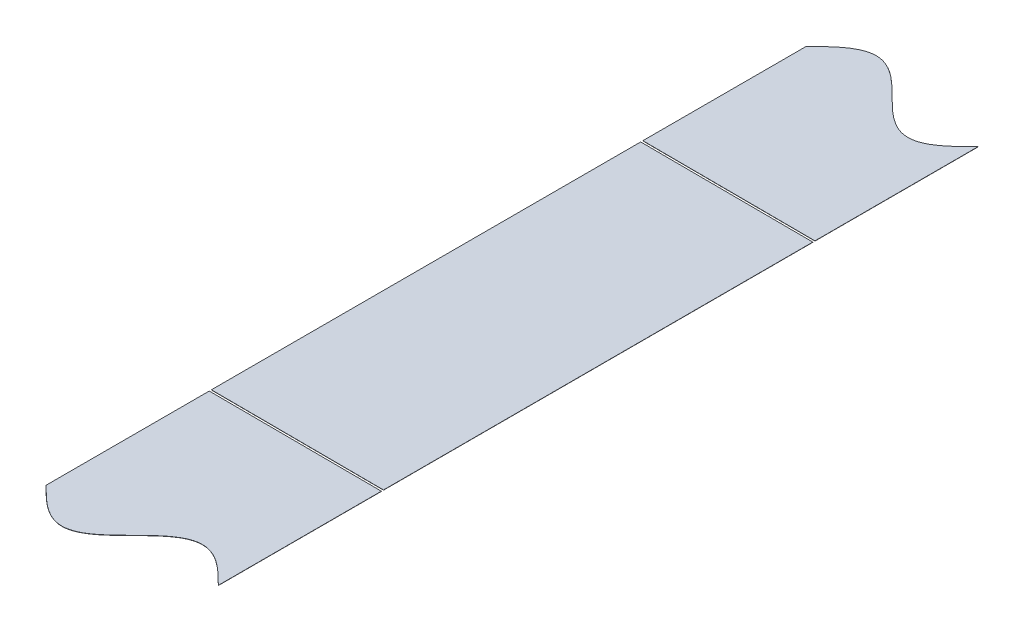
ISO-10303-21;
HEADER;
FILE_DESCRIPTION(('STEP AP214'),'2;1');
FILE_NAME('part.step','',(''),(''),'','','');
FILE_SCHEMA(('AUTOMOTIVE_DESIGN { 1 0 10303 214 1 1 1 1 }'));
ENDSEC;
DATA;
#1=APPLICATION_CONTEXT('core data for automotive mechanical design processes');
#2=APPLICATION_PROTOCOL_DEFINITION('international standard','automotive_design',2000,#1);
#3=PRODUCT_CONTEXT('',#1,'mechanical');
#4=PRODUCT('Part','Part','',(#3));
#5=PRODUCT_RELATED_PRODUCT_CATEGORY('part','',(#4));
#6=PRODUCT_DEFINITION_FORMATION('','',#4);
#7=PRODUCT_DEFINITION_CONTEXT('part definition',#1,'design');
#8=PRODUCT_DEFINITION('design','',#6,#7);
#9=PRODUCT_DEFINITION_SHAPE('','',#8);
#10=(LENGTH_UNIT() NAMED_UNIT(*) SI_UNIT(.MILLI.,.METRE.));
#11=(NAMED_UNIT(*) PLANE_ANGLE_UNIT() SI_UNIT($,.RADIAN.));
#12=(NAMED_UNIT(*) SI_UNIT($,.STERADIAN.) SOLID_ANGLE_UNIT());
#13=UNCERTAINTY_MEASURE_WITH_UNIT(LENGTH_MEASURE(1.E-05),#10,'distance_accuracy_value','');
#14=(GEOMETRIC_REPRESENTATION_CONTEXT(3) GLOBAL_UNCERTAINTY_ASSIGNED_CONTEXT((#13)) GLOBAL_UNIT_ASSIGNED_CONTEXT((#10,
#11,#12)) REPRESENTATION_CONTEXT('',''));
#15=CARTESIAN_POINT('',(0.,0.,0.));
#16=DIRECTION('',(0.,0.,1.));
#17=DIRECTION('',(1.,0.,0.));
#18=AXIS2_PLACEMENT_3D('',#15,#16,#17);
#19=CARTESIAN_POINT('',(-621.794395504832,395.512091266232,-3681.16559912433));
#20=DIRECTION('',(0.00396825396827997,0.999992126449225,0.));
#21=DIRECTION('',(-0.999992126449225,0.00396825396827997,0.));
#22=AXIS2_PLACEMENT_3D('',#19,#20,#21);
#23=PLANE('',#22);
#24=DIRECTION('',(0.,0.,1.));
#25=VECTOR('',#24,1.);
#26=CARTESIAN_POINT('',(2884.05,381.59990079326,-175.293599958301));
#27=LINE('',#26,#25);
#28=CARTESIAN_POINT('',(2884.05,381.59990079326,100.));
#29=VERTEX_POINT('',#28);
#30=CARTESIAN_POINT('',(2884.05,381.59990079326,175.293599958303));
#31=VERTEX_POINT('',#30);
#32=EDGE_CURVE('E110',#29,#31,#27,.T.);
#33=ORIENTED_EDGE('',*,*,#32,.F.);
#34=DIRECTION('',(0.999992126449225,-0.00396825396827997,0.));
#35=VECTOR('',#34,1.);
#36=CARTESIAN_POINT('',(-621.794395504832,395.512091266232,100.));
#37=LINE('',#36,#35);
#38=CARTESIAN_POINT('',(2963.43127202954,381.284893265294,100.));
#39=VERTEX_POINT('',#38);
#40=EDGE_CURVE('E70',#29,#39,#37,.T.);
#41=ORIENTED_EDGE('',*,*,#40,.T.);
#42=DIRECTION('',(0.,0.,1.));
#43=VECTOR('',#42,1.);
#44=CARTESIAN_POINT('',(2963.43127202953,381.284893265294,-175.193599958301));
#45=LINE('',#44,#43);
#46=CARTESIAN_POINT('',(2963.43127202954,381.284893265294,175.193599958303));
#47=VERTEX_POINT('',#46);
#48=EDGE_CURVE('E57',#39,#47,#45,.T.);
#49=ORIENTED_EDGE('',*,*,#48,.T.);
#50=CARTESIAN_POINT('',(2884.05,381.59990079326,175.293599958303));
#51=CARTESIAN_POINT('',(2884.44900275421,381.598317436531,175.691025621414));
#52=CARTESIAN_POINT('',(2884.67016618773,381.597439796948,175.911007405777));
#53=CARTESIAN_POINT('',(2885.01284043788,381.596079967788,176.251850789343));
#54=CARTESIAN_POINT('',(2885.62029802492,381.593669402828,176.853766323541));
#55=CARTESIAN_POINT('',(2886.2348307219,381.591230761814,177.458905931201));
#56=CARTESIAN_POINT('',(2886.85180442637,381.588782434186,178.061187776924));
#57=CARTESIAN_POINT('',(2887.46990703982,381.586329626725,178.657850633466));
#58=CARTESIAN_POINT('',(2888.08862391969,381.58387438168,179.246943539566));
#59=CARTESIAN_POINT('',(2888.70771164539,381.581417665012,179.826805292829));
#60=CARTESIAN_POINT('',(2889.32704055818,381.578959991246,180.395911021721));
#61=CARTESIAN_POINT('',(2889.94653500399,381.576501660597,180.952816062257));
#62=CARTESIAN_POINT('',(2890.88857872217,381.572763362441,181.778862747914));
#63=CARTESIAN_POINT('',(2892.12570234937,381.567854103044,182.801225095618));
#64=CARTESIAN_POINT('',(2893.36357306313,381.562941878996,183.751910080358));
#65=CARTESIAN_POINT('',(2894.60192315181,381.558027752651,184.621504416246));
#66=CARTESIAN_POINT('',(2895.84059602389,381.553112345409,185.401489653719));
#67=CARTESIAN_POINT('',(2897.07949333798,381.548196047517,186.084270089632));
#68=CARTESIAN_POINT('',(2898.3185495348,381.543279119134,186.663219669498));
#69=CARTESIAN_POINT('',(2899.55771848087,381.538361743329,187.132732016565));
#70=CARTESIAN_POINT('',(2900.79696596885,381.533444055847,187.488266726695));
#71=CARTESIAN_POINT('',(2902.02997589461,381.528551120792,187.725180183972));
#72=CARTESIAN_POINT('',(2903.25680530536,381.523682711782,187.843600231955));
#73=CARTESIAN_POINT('',(2903.88275359037,381.521198770459,187.843599952654));
#74=CARTESIAN_POINT('',(2904.51493130274,381.518690108991,187.842352340713));
#75=CARTESIAN_POINT('',(2905.75425897102,381.513772103331,187.719074671948));
#76=CARTESIAN_POINT('',(2906.99355651627,381.508854217208,187.476155306059));
#77=CARTESIAN_POINT('',(2908.23280138851,381.503936540107,187.115940101572));
#78=CARTESIAN_POINT('',(2909.47196651117,381.499019179474,186.641909561395));
#79=CARTESIAN_POINT('',(2910.71101730635,381.494102272526,186.058647977678));
#80=CARTESIAN_POINT('',(2911.949906989,381.489186004918,185.371803892243));
#81=CARTESIAN_POINT('',(2913.18856897751,381.484270640865,184.588043540144));
#82=CARTESIAN_POINT('',(2914.42690322463,381.479356577384,183.715000747353));
#83=CARTESIAN_POINT('',(2915.66475000555,381.474444448308,182.761230401478));
#84=CARTESIAN_POINT('',(2916.90183509568,381.469535341837,181.736182119725));
#85=CARTESIAN_POINT('',(2917.84398064896,381.46579663957,180.908288699699));
#86=CARTESIAN_POINT('',(2918.4634637693,381.463338353864,180.350345268312));
#87=CARTESIAN_POINT('',(2919.08277664979,381.460880743718,179.780315465008));
#88=CARTESIAN_POINT('',(2919.70184033163,381.458424122464,179.199649485736));
#89=CARTESIAN_POINT('',(2920.32051875954,381.455969030007,178.609880564441));
#90=CARTESIAN_POINT('',(2920.93855497185,381.453516486045,178.012685115911));
#91=CARTESIAN_POINT('',(2921.55539810147,381.451068676575,177.410051600892));
#92=CARTESIAN_POINT('',(2922.16961633362,381.448631283447,176.804861613959));
#93=CARTESIAN_POINT('',(2922.77595992045,381.446225139157,176.203810908444));
#94=CARTESIAN_POINT('',(2923.25825852217,381.444311240748,175.72399210532));
#95=CARTESIAN_POINT('',(2923.5338910667,381.443217452197,175.449529353548));
#96=CARTESIAN_POINT('',(2923.94733401057,381.441576792677,175.03771733011));
#97=CARTESIAN_POINT('',(2924.2229455626,381.440483087431,174.763275444279));
#98=CARTESIAN_POINT('',(2924.70524378095,381.438569190543,174.283456891095));
#99=CARTESIAN_POINT('',(2925.31158597793,381.436163051768,173.68240723069));
#100=CARTESIAN_POINT('',(2925.92580402107,381.43372565939,173.077216931859));
#101=CARTESIAN_POINT('',(2926.54264687146,381.431277851029,172.474583022645));
#102=CARTESIAN_POINT('',(2927.16068278245,381.428825308262,171.87738703287));
#103=CARTESIAN_POINT('',(2927.77936114426,381.426370216067,171.287617173664));
#104=CARTESIAN_POINT('',(2928.39842473084,381.423913595191,170.70695012669));
#105=CARTESIAN_POINT('',(2929.01773738759,381.421455985933,170.136919206769));
#106=CARTESIAN_POINT('',(2929.63722048514,381.418997700318,169.578974317699));
#107=CARTESIAN_POINT('',(2930.57936625014,381.41525899721,168.751078232698));
#108=CARTESIAN_POINT('',(2931.81645132748,381.410349890791,167.726026132325));
#109=CARTESIAN_POINT('',(2933.05429806009,381.405437761906,166.772251445878));
#110=CARTESIAN_POINT('',(2934.29263226124,381.400523698607,165.899203804224));
#111=CARTESIAN_POINT('',(2935.53129425844,381.39560833452,165.115438104594));
#112=CARTESIAN_POINT('',(2936.77018396465,381.390692066819,164.428588266424));
#113=CARTESIAN_POINT('',(2938.00923473979,381.38577515995,163.84532060058));
#114=CARTESIAN_POINT('',(2939.24839986578,381.380857799304,163.371283676504));
#115=CARTESIAN_POINT('',(2940.48764473458,381.375940122216,163.011061862295));
#116=CARTESIAN_POINT('',(2941.72694226685,381.371022236145,162.768135720721));
#117=CARTESIAN_POINT('',(2942.96626993122,381.3661042305,162.644851172782));
#118=CARTESIAN_POINT('',(2944.20560763773,381.361186185006,162.642398407556));
#119=CARTESIAN_POINT('',(2945.44493609165,381.356268176228,162.76080110203));
#120=CARTESIAN_POINT('',(2946.68423526271,381.351350283654,162.998916205654));
#121=CARTESIAN_POINT('',(2947.92348275768,381.346432596144,163.354444296083));
#122=CARTESIAN_POINT('',(2949.1626517136,381.341515220301,163.823950253892));
#123=CARTESIAN_POINT('',(2950.40170791263,381.336598291908,164.402893729754));
#124=CARTESIAN_POINT('',(2951.64060525855,381.33168199389,165.085668425485));
#125=CARTESIAN_POINT('',(2952.87927816171,381.326766586525,165.865648331297));
#126=CARTESIAN_POINT('',(2954.11762830693,381.321852459956,166.735237808971));
#127=CARTESIAN_POINT('',(2955.35549906181,381.316940235744,167.685918434696));
#128=CARTESIAN_POINT('',(2956.59262269846,381.31203097631,168.70827693913));
#129=CARTESIAN_POINT('',(2957.5346662733,381.308292678722,169.534321007098));
#130=CARTESIAN_POINT('',(2958.1541606404,381.305834348386,170.091224489268));
#131=CARTESIAN_POINT('',(2958.77348967054,381.303376674154,170.660328989489));
#132=CARTESIAN_POINT('',(2959.39257759728,381.300919956689,171.240189760136));
#133=CARTESIAN_POINT('',(2960.01129436986,381.298464712069,171.829281552269));
#134=CARTESIAN_POINT('',(2960.62939725599,381.296011903526,172.42594382095));
#135=CARTESIAN_POINT('',(2961.2463711206,381.293563575262,173.028225144418));
#136=CARTESIAN_POINT('',(2961.86090358267,381.29112493518,173.633364003138));
#137=CARTESIAN_POINT('',(2962.46836304824,381.288714362766,174.235281049865));
#138=CARTESIAN_POINT('',(2962.8111058418,381.287354261606,174.57619251083));
#139=CARTESIAN_POINT('',(2963.03222295052,381.286476805854,174.796128153504));
#140=CARTESIAN_POINT('',(2963.43127202954,381.284893265294,175.193599958303));
#141=B_SPLINE_CURVE_WITH_KNOTS('',2,(#50,#51,#52,#53,#54,#55,#56,#57,#58,#59,#60,#61,#62,#63,
#64,#65,#66,#67,#68,#69,#70,#71,#72,#73,#74,#75,#76,#77,#78,#79,#80,#81,#82,#83,#84,#85,#86,#87,
#88,#89,#90,#91,#92,#93,#94,#95,#96,#97,#98,#99,#100,#101,#102,#103,#104,#105,#106,#107,#108,
#109,#110,#111,#112,#113,#114,#115,#116,#117,#118,#119,#120,#121,#122,#123,#124,#125,#126,#127,
#128,#129,#130,#131,#132,#133,#134,#135,#136,#137,#138,#139,#140),.UNSPECIFIED.,.F.,.F.,(3,2,1,
1,1,1,1,1,1,1,1,1,1,1,1,1,1,1,1,1,1,1,1,1,1,1,1,1,1,1,1,1,1,1,1,1,1,1,1,1,1,1,1,1,1,1,1,1,1,1,1,
1,1,1,1,1,1,1,1,1,1,1,1,1,1,1,1,1,1,1,1,1,1,1,1,1,1,1,1,1,1,1,1,1,1,1,2,3),(0.,0.0078125,
0.015625,0.0234375,0.03125,0.0390625,0.046875,0.0546875,0.0625,0.0703125,0.078125,0.09375,
0.109375,0.125,0.140625,0.15625,0.171875,0.1875,0.203125,0.21875,0.234217166900635,
0.24968433380127,0.25,0.265625,0.28125,0.296875,0.3125,0.328125,0.34375,0.359375,0.375,0.390625,
0.40625,0.421875,0.4296875,0.4375,0.4453125,0.453125,0.4609375,0.46875,0.4765625,0.484375,
0.4921875,0.49609375,0.5,0.50390625,0.5078125,0.515625,0.5234375,0.53125,0.5390625,0.546875,
0.5546875,0.5625,0.5703125,0.578125,0.59375,0.609375,0.625,0.640625,0.65625,0.671875,0.6875,
0.703125,0.71875,0.734375,0.75,0.765625,0.78125,0.796875,0.8125,0.828125,0.84375,0.859375,0.875,
0.890625,0.90625,0.921875,0.9296875,0.9375,0.9453125,0.953125,0.9609375,0.96875,0.9765625,
0.984375,0.9921875,1.),.UNSPECIFIED.);
#142=EDGE_CURVE('E120',#31,#47,#141,.T.);
#143=ORIENTED_EDGE('',*,*,#142,.F.);
#144=EDGE_LOOP('',(#33,#41,#49,#143));
#145=FACE_BOUND('',#144,.T.);
#146=ADVANCED_FACE('F54',(#145),#23,.F.);
#147=CARTESIAN_POINT('',(-621.793998679435,395.612090478877,-3681.16559912433));
#148=DIRECTION('',(0.00396825396827997,0.999992126449225,0.));
#149=DIRECTION('',(-0.999992126449225,0.00396825396827997,0.));
#150=AXIS2_PLACEMENT_3D('',#147,#148,#149);
#151=PLANE('',#150);
#152=DIRECTION('',(0.999992126449225,-0.00396825396828014,0.));
#153=VECTOR('',#152,1.);
#154=CARTESIAN_POINT('',(2884.0503968254,381.699900005905,100.));
#155=LINE('',#154,#153);
#156=CARTESIAN_POINT('',(2884.0503968254,381.699900005905,100.));
#157=VERTEX_POINT('',#156);
#158=CARTESIAN_POINT('',(2963.43166885493,381.384892477939,100.));
#159=VERTEX_POINT('',#158);
#160=EDGE_CURVE('E63',#157,#159,#155,.T.);
#161=ORIENTED_EDGE('',*,*,#160,.F.);
#162=DIRECTION('',(0.,0.,1.));
#163=VECTOR('',#162,1.);
#164=CARTESIAN_POINT('',(2884.0503968254,381.699900005905,-175.293599958301));
#165=LINE('',#164,#163);
#166=CARTESIAN_POINT('',(2884.0503968254,381.699900005905,175.293599958303));
#167=VERTEX_POINT('',#166);
#168=EDGE_CURVE('E101',#157,#167,#165,.T.);
#169=ORIENTED_EDGE('',*,*,#168,.T.);
#170=CARTESIAN_POINT('',(2884.0503968254,381.699900005905,175.293599958303));
#171=CARTESIAN_POINT('',(2884.44939957961,381.698316649176,175.691025621414));
#172=CARTESIAN_POINT('',(2884.67056301313,381.697439009593,175.911007405777));
#173=CARTESIAN_POINT('',(2885.01323726327,381.696079180433,176.251850789343));
#174=CARTESIAN_POINT('',(2885.62069485032,381.693668615473,176.853766323541));
#175=CARTESIAN_POINT('',(2886.2352275473,381.691229974459,177.458905931201));
#176=CARTESIAN_POINT('',(2886.85220125176,381.688781646831,178.061187776924));
#177=CARTESIAN_POINT('',(2887.47030386521,381.68632883937,178.657850633466));
#178=CARTESIAN_POINT('',(2888.08902074509,381.683873594325,179.246943539566));
#179=CARTESIAN_POINT('',(2888.70810847079,381.681416877657,179.826805292829));
#180=CARTESIAN_POINT('',(2889.32743738357,381.678959203891,180.395911021721));
#181=CARTESIAN_POINT('',(2889.94693182939,381.676500873242,180.952816062257));
#182=CARTESIAN_POINT('',(2890.88897554757,381.672762575086,181.778862747914));
#183=CARTESIAN_POINT('',(2892.12609917477,381.667853315689,182.801225095618));
#184=CARTESIAN_POINT('',(2893.36396988853,381.662941091641,183.751910080358));
#185=CARTESIAN_POINT('',(2894.60231997721,381.658026965295,184.621504416246));
#186=CARTESIAN_POINT('',(2895.84099284928,381.653111558054,185.401489653719));
#187=CARTESIAN_POINT('',(2897.07989016338,381.648195260162,186.084270089632));
#188=CARTESIAN_POINT('',(2898.3189463602,381.643278331778,186.663219669498));
#189=CARTESIAN_POINT('',(2899.55811530626,381.638360955974,187.132732016565));
#190=CARTESIAN_POINT('',(2900.79736279425,381.633443268492,187.488266726695));
#191=CARTESIAN_POINT('',(2902.03037272001,381.628550333437,187.725180183972));
#192=CARTESIAN_POINT('',(2903.25720213076,381.623681924427,187.843600231955));
#193=CARTESIAN_POINT('',(2903.88315041577,381.621197983104,187.843599952654));
#194=CARTESIAN_POINT('',(2904.51532812814,381.618689321636,187.842352340713));
#195=CARTESIAN_POINT('',(2905.75465579642,381.613771315976,187.719074671948));
#196=CARTESIAN_POINT('',(2906.99395334167,381.608853429853,187.476155306059));
#197=CARTESIAN_POINT('',(2908.23319821391,381.603935752752,187.115940101572));
#198=CARTESIAN_POINT('',(2909.47236333657,381.599018392119,186.641909561395));
#199=CARTESIAN_POINT('',(2910.71141413175,381.594101485171,186.058647977678));
#200=CARTESIAN_POINT('',(2911.9503038144,381.589185217563,185.371803892243));
#201=CARTESIAN_POINT('',(2913.18896580291,381.58426985351,184.588043540144));
#202=CARTESIAN_POINT('',(2914.42730005002,381.579355790029,183.715000747353));
#203=CARTESIAN_POINT('',(2915.66514683095,381.574443660953,182.761230401478));
#204=CARTESIAN_POINT('',(2916.90223192108,381.569534554482,181.736182119725));
#205=CARTESIAN_POINT('',(2917.84437747436,381.565795852215,180.908288699699));
#206=CARTESIAN_POINT('',(2918.4638605947,381.563337566509,180.350345268312));
#207=CARTESIAN_POINT('',(2919.08317347519,381.560879956363,179.780315465008));
#208=CARTESIAN_POINT('',(2919.70223715703,381.558423335109,179.199649485736));
#209=CARTESIAN_POINT('',(2920.32091558493,381.555968242652,178.609880564441));
#210=CARTESIAN_POINT('',(2920.93895179724,381.55351569869,178.012685115911));
#211=CARTESIAN_POINT('',(2921.55579492686,381.55106788922,177.410051600892));
#212=CARTESIAN_POINT('',(2922.17001315902,381.548630496092,176.804861613959));
#213=CARTESIAN_POINT('',(2922.77635674585,381.546224351802,176.203810908444));
#214=CARTESIAN_POINT('',(2923.25865534757,381.544310453393,175.72399210532));
#215=CARTESIAN_POINT('',(2923.5342878921,381.543216664842,175.449529353548));
#216=CARTESIAN_POINT('',(2923.94773083597,381.541576005322,175.03771733011));
#217=CARTESIAN_POINT('',(2924.223342388,381.540482300075,174.763275444279));
#218=CARTESIAN_POINT('',(2924.70564060634,381.538568403187,174.283456891095));
#219=CARTESIAN_POINT('',(2925.31198280333,381.536162264413,173.68240723069));
#220=CARTESIAN_POINT('',(2925.92620084646,381.533724872035,173.077216931859));
#221=CARTESIAN_POINT('',(2926.54304369686,381.531277063673,172.474583022645));
#222=CARTESIAN_POINT('',(2927.16107960785,381.528824520907,171.87738703287));
#223=CARTESIAN_POINT('',(2927.77975796965,381.526369428712,171.287617173664));
#224=CARTESIAN_POINT('',(2928.39882155624,381.523912807836,170.70695012669));
#225=CARTESIAN_POINT('',(2929.01813421299,381.521455198578,170.136919206769));
#226=CARTESIAN_POINT('',(2929.63761731054,381.518996912962,169.578974317699));
#227=CARTESIAN_POINT('',(2930.57976307553,381.515258209855,168.751078232698));
#228=CARTESIAN_POINT('',(2931.81684815288,381.510349103436,167.726026132325));
#229=CARTESIAN_POINT('',(2933.05469488548,381.505436974551,166.772251445878));
#230=CARTESIAN_POINT('',(2934.29302908664,381.500522911252,165.899203804224));
#231=CARTESIAN_POINT('',(2935.53169108384,381.495607547165,165.115438104594));
#232=CARTESIAN_POINT('',(2936.77058079004,381.490691279463,164.428588266424));
#233=CARTESIAN_POINT('',(2938.00963156519,381.485774372595,163.84532060058));
#234=CARTESIAN_POINT('',(2939.24879669118,381.480857011949,163.371283676504));
#235=CARTESIAN_POINT('',(2940.48804155998,381.475939334861,163.011061862295));
#236=CARTESIAN_POINT('',(2941.72733909225,381.47102144879,162.768135720721));
#237=CARTESIAN_POINT('',(2942.96666675661,381.466103443145,162.644851172782));
#238=CARTESIAN_POINT('',(2944.20600446313,381.461185397651,162.642398407556));
#239=CARTESIAN_POINT('',(2945.44533291705,381.456267388873,162.76080110203));
#240=CARTESIAN_POINT('',(2946.68463208811,381.451349496299,162.998916205654));
#241=CARTESIAN_POINT('',(2947.92387958308,381.446431808789,163.354444296083));
#242=CARTESIAN_POINT('',(2949.163048539,381.441514432945,163.823950253892));
#243=CARTESIAN_POINT('',(2950.40210473803,381.436597504553,164.402893729754));
#244=CARTESIAN_POINT('',(2951.64100208395,381.431681206535,165.085668425485));
#245=CARTESIAN_POINT('',(2952.87967498711,381.42676579917,165.865648331297));
#246=CARTESIAN_POINT('',(2954.11802513233,381.4218516726,166.735237808971));
#247=CARTESIAN_POINT('',(2955.35589588721,381.416939448389,167.685918434696));
#248=CARTESIAN_POINT('',(2956.59301952386,381.412030188955,168.70827693913));
#249=CARTESIAN_POINT('',(2957.5350630987,381.408291891367,169.534321007098));
#250=CARTESIAN_POINT('',(2958.1545574658,381.405833561031,170.091224489268));
#251=CARTESIAN_POINT('',(2958.77388649593,381.403375886799,170.660328989489));
#252=CARTESIAN_POINT('',(2959.39297442267,381.400919169334,171.240189760136));
#253=CARTESIAN_POINT('',(2960.01169119526,381.398463924714,171.829281552269));
#254=CARTESIAN_POINT('',(2960.62979408138,381.396011116171,172.42594382095));
#255=CARTESIAN_POINT('',(2961.246767946,381.393562787907,173.028225144418));
#256=CARTESIAN_POINT('',(2961.86130040807,381.391124147825,173.633364003138));
#257=CARTESIAN_POINT('',(2962.46875987363,381.388713575411,174.235281049865));
#258=CARTESIAN_POINT('',(2962.8115026672,381.387353474251,174.57619251083));
#259=CARTESIAN_POINT('',(2963.03261977591,381.386476018499,174.796128153504));
#260=CARTESIAN_POINT('',(2963.43166885493,381.384892477939,175.193599958303));
#261=B_SPLINE_CURVE_WITH_KNOTS('',2,(#170,#171,#172,#173,#174,#175,#176,#177,#178,#179,#180,
#181,#182,#183,#184,#185,#186,#187,#188,#189,#190,#191,#192,#193,#194,#195,#196,#197,#198,#199,
#200,#201,#202,#203,#204,#205,#206,#207,#208,#209,#210,#211,#212,#213,#214,#215,#216,#217,#218,
#219,#220,#221,#222,#223,#224,#225,#226,#227,#228,#229,#230,#231,#232,#233,#234,#235,#236,#237,
#238,#239,#240,#241,#242,#243,#244,#245,#246,#247,#248,#249,#250,#251,#252,#253,#254,#255,#256,
#257,#258,#259,#260),.UNSPECIFIED.,.F.,.F.,(3,2,1,1,1,1,1,1,1,1,1,1,1,1,1,1,1,1,1,1,1,1,1,1,1,1,
1,1,1,1,1,1,1,1,1,1,1,1,1,1,1,1,1,1,1,1,1,1,1,1,1,1,1,1,1,1,1,1,1,1,1,1,1,1,1,1,1,1,1,1,1,1,1,1,
1,1,1,1,1,1,1,1,1,1,1,1,2,3),(0.,0.0078125,0.015625,0.0234375,0.03125,0.0390625,0.046875,
0.0546875,0.0625,0.0703125,0.078125,0.09375,0.109375,0.125,0.140625,0.15625,0.171875,0.1875,
0.203125,0.21875,0.234217166900635,0.24968433380127,0.25,0.265625,0.28125,0.296875,0.3125,
0.328125,0.34375,0.359375,0.375,0.390625,0.40625,0.421875,0.4296875,0.4375,0.4453125,0.453125,
0.4609375,0.46875,0.4765625,0.484375,0.4921875,0.49609375,0.5,0.50390625,0.5078125,0.515625,
0.5234375,0.53125,0.5390625,0.546875,0.5546875,0.5625,0.5703125,0.578125,0.59375,0.609375,0.625,
0.640625,0.65625,0.671875,0.6875,0.703125,0.71875,0.734375,0.75,0.765625,0.78125,0.796875,
0.8125,0.828125,0.84375,0.859375,0.875,0.890625,0.90625,0.921875,0.9296875,0.9375,0.9453125,
0.953125,0.9609375,0.96875,0.9765625,0.984375,0.9921875,1.),.UNSPECIFIED.);
#262=CARTESIAN_POINT('',(2963.43166885493,381.384892477939,175.193599958303));
#263=VERTEX_POINT('',#262);
#264=EDGE_CURVE('E108',#167,#263,#261,.T.);
#265=ORIENTED_EDGE('',*,*,#264,.T.);
#266=DIRECTION('',(0.,0.,1.));
#267=VECTOR('',#266,1.);
#268=CARTESIAN_POINT('',(2963.43166885493,381.384892477939,-175.193599958301));
#269=LINE('',#268,#267);
#270=EDGE_CURVE('E103',#159,#263,#269,.T.);
#271=ORIENTED_EDGE('',*,*,#270,.F.);
#272=EDGE_LOOP('',(#161,#169,#265,#271));
#273=FACE_BOUND('',#272,.T.);
#274=ADVANCED_FACE('F99',(#273),#151,.T.);
#275=CARTESIAN_POINT('',(2884.0503968254,381.699900005905,-175.293599958301));
#276=DIRECTION('',(0.999992126449225,-0.00396825396827997,0.));
#277=DIRECTION('',(0.00396825396827997,0.999992126449225,0.));
#278=AXIS2_PLACEMENT_3D('',#275,#276,#277);
#279=PLANE('',#278);
#280=ORIENTED_EDGE('',*,*,#168,.F.);
#281=DIRECTION('',(0.00396825396827997,0.999992126449225,0.));
#282=VECTOR('',#281,1.);
#283=CARTESIAN_POINT('',(2884.01071428572,371.699978741413,100.));
#284=LINE('',#283,#282);
#285=EDGE_CURVE('E90',#29,#157,#284,.T.);
#286=ORIENTED_EDGE('',*,*,#285,.F.);
#287=ORIENTED_EDGE('',*,*,#32,.T.);
#288=DIRECTION('',(-0.00396825396827997,-0.999992126449225,0.));
#289=VECTOR('',#288,1.);
#290=CARTESIAN_POINT('',(2884.0503968254,381.699900005905,175.293599958303));
#291=LINE('',#290,#289);
#292=EDGE_CURVE('E95',#167,#31,#291,.T.);
#293=ORIENTED_EDGE('',*,*,#292,.F.);
#294=EDGE_LOOP('',(#280,#286,#287,#293));
#295=FACE_BOUND('',#294,.T.);
#296=ADVANCED_FACE('F105',(#295),#279,.F.);
#297=CARTESIAN_POINT('',(2963.43166885493,381.384892477939,-175.193599958301));
#298=DIRECTION('',(0.999992126449225,-0.00396825396827997,0.));
#299=DIRECTION('',(0.00396825396827997,0.999992126449225,0.));
#300=AXIS2_PLACEMENT_3D('',#297,#298,#299);
#301=PLANE('',#300);
#302=DIRECTION('',(-0.00396825396827997,-0.999992126449225,0.));
#303=VECTOR('',#302,1.);
#304=CARTESIAN_POINT('',(2963.43166885493,381.384892477939,100.));
#305=LINE('',#304,#303);
#306=EDGE_CURVE('E14',#159,#39,#305,.T.);
#307=ORIENTED_EDGE('',*,*,#306,.F.);
#308=ORIENTED_EDGE('',*,*,#270,.T.);
#309=DIRECTION('',(-0.00396825396827997,-0.999992126449225,0.));
#310=VECTOR('',#309,1.);
#311=CARTESIAN_POINT('',(2963.43166885493,381.384892477939,175.193599958303));
#312=LINE('',#311,#310);
#313=EDGE_CURVE('E113',#263,#47,#312,.T.);
#314=ORIENTED_EDGE('',*,*,#313,.T.);
#315=ORIENTED_EDGE('',*,*,#48,.F.);
#316=EDGE_LOOP('',(#307,#308,#314,#315));
#317=FACE_BOUND('',#316,.T.);
#318=ADVANCED_FACE('F141',(#317),#301,.T.);
#319=DIRECTION('',(-0.00396825396827997,-0.999992126449225,0.));
#320=VECTOR('',#319,1.);
#321=SURFACE_OF_LINEAR_EXTRUSION('',#261,#320);
#322=ORIENTED_EDGE('',*,*,#142,.T.);
#323=ORIENTED_EDGE('',*,*,#313,.F.);
#324=ORIENTED_EDGE('',*,*,#264,.F.);
#325=ORIENTED_EDGE('',*,*,#292,.T.);
#326=EDGE_LOOP('',(#322,#323,#324,#325));
#327=FACE_BOUND('',#326,.T.);
#328=ADVANCED_FACE('F118',(#327),#321,.F.);
#329=CARTESIAN_POINT('',(2884.01071428572,371.699978741413,100.));
#330=DIRECTION('',(0.,0.,1.));
#331=DIRECTION('',(1.,0.,0.));
#332=AXIS2_PLACEMENT_3D('',#329,#330,#331);
#333=PLANE('',#332);
#334=ORIENTED_EDGE('',*,*,#285,.T.);
#335=ORIENTED_EDGE('',*,*,#160,.T.);
#336=ORIENTED_EDGE('',*,*,#306,.T.);
#337=ORIENTED_EDGE('',*,*,#40,.F.);
#338=EDGE_LOOP('',(#334,#335,#336,#337));
#339=FACE_BOUND('',#338,.T.);
#340=ADVANCED_FACE('F91',(#339),#333,.F.);
#341=CLOSED_SHELL('',(#146,#274,#296,#318,#328,#340));
#342=MANIFOLD_SOLID_BREP('B2',#341);
#343=CARTESIAN_POINT('',(2963.43166885493,381.384892477939,-175.193599958301));
#344=DIRECTION('',(0.999992126449225,-0.00396825396827997,0.));
#345=DIRECTION('',(0.00396825396827997,0.999992126449225,0.));
#346=AXIS2_PLACEMENT_3D('',#343,#344,#345);
#347=PLANE('',#346);
#348=DIRECTION('',(0.00396825396827997,0.999992126449225,0.));
#349=VECTOR('',#348,1.);
#350=CARTESIAN_POINT('',(2963.39198631525,371.384971213447,-100.));
#351=LINE('',#350,#349);
#352=CARTESIAN_POINT('',(2963.43127202954,381.284893265294,-100.));
#353=VERTEX_POINT('',#352);
#354=CARTESIAN_POINT('',(2963.43166885493,381.384892477939,-100.));
#355=VERTEX_POINT('',#354);
#356=EDGE_CURVE('E213',#353,#355,#351,.T.);
#357=ORIENTED_EDGE('',*,*,#356,.F.);
#358=DIRECTION('',(0.,0.,1.));
#359=VECTOR('',#358,1.);
#360=CARTESIAN_POINT('',(2963.43127202953,381.284893265294,-175.193599958301));
#361=LINE('',#360,#359);
#362=CARTESIAN_POINT('',(2963.43127202953,381.284893265294,-175.1935999583));
#363=VERTEX_POINT('',#362);
#364=EDGE_CURVE('E207',#363,#353,#361,.T.);
#365=ORIENTED_EDGE('',*,*,#364,.F.);
#366=DIRECTION('',(-0.00396825396827997,-0.999992126449225,0.));
#367=VECTOR('',#366,1.);
#368=CARTESIAN_POINT('',(2963.43166885493,381.384892477939,-175.1935999583));
#369=LINE('',#368,#367);
#370=CARTESIAN_POINT('',(2963.43166885493,381.384892477939,-175.1935999583));
#371=VERTEX_POINT('',#370);
#372=EDGE_CURVE('E239',#371,#363,#369,.T.);
#373=ORIENTED_EDGE('',*,*,#372,.F.);
#374=DIRECTION('',(0.,0.,1.));
#375=VECTOR('',#374,1.);
#376=CARTESIAN_POINT('',(2963.43166885493,381.384892477939,-175.193599958301));
#377=LINE('',#376,#375);
#378=EDGE_CURVE('E253',#371,#355,#377,.T.);
#379=ORIENTED_EDGE('',*,*,#378,.T.);
#380=EDGE_LOOP('',(#357,#365,#373,#379));
#381=FACE_BOUND('',#380,.T.);
#382=ADVANCED_FACE('F204',(#381),#347,.T.);
#383=CARTESIAN_POINT('',(2884.0503968254,381.699900005905,-175.293599958301));
#384=DIRECTION('',(0.999992126449225,-0.00396825396827997,0.));
#385=DIRECTION('',(0.00396825396827997,0.999992126449225,0.));
#386=AXIS2_PLACEMENT_3D('',#383,#384,#385);
#387=PLANE('',#386);
#388=DIRECTION('',(0.,0.,1.));
#389=VECTOR('',#388,1.);
#390=CARTESIAN_POINT('',(2884.05,381.59990079326,-175.293599958301));
#391=LINE('',#390,#389);
#392=CARTESIAN_POINT('',(2884.05,381.59990079326,-175.293599958299));
#393=VERTEX_POINT('',#392);
#394=CARTESIAN_POINT('',(2884.05,381.59990079326,-100.));
#395=VERTEX_POINT('',#394);
#396=EDGE_CURVE('E262',#393,#395,#391,.T.);
#397=ORIENTED_EDGE('',*,*,#396,.T.);
#398=DIRECTION('',(0.00396825396827997,0.999992126449225,0.));
#399=VECTOR('',#398,1.);
#400=CARTESIAN_POINT('',(2884.01071428572,371.699978741413,-100.));
#401=LINE('',#400,#399);
#402=CARTESIAN_POINT('',(2884.0503968254,381.699900005905,-100.));
#403=VERTEX_POINT('',#402);
#404=EDGE_CURVE('E295',#395,#403,#401,.T.);
#405=ORIENTED_EDGE('',*,*,#404,.T.);
#406=DIRECTION('',(0.,0.,1.));
#407=VECTOR('',#406,1.);
#408=CARTESIAN_POINT('',(2884.0503968254,381.699900005905,-175.293599958301));
#409=LINE('',#408,#407);
#410=CARTESIAN_POINT('',(2884.0503968254,381.699900005905,-175.293599958299));
#411=VERTEX_POINT('',#410);
#412=EDGE_CURVE('E297',#411,#403,#409,.T.);
#413=ORIENTED_EDGE('',*,*,#412,.F.);
#414=DIRECTION('',(-0.00396825396827997,-0.999992126449225,0.));
#415=VECTOR('',#414,1.);
#416=CARTESIAN_POINT('',(2884.0503968254,381.699900005905,-175.293599958299));
#417=LINE('',#416,#415);
#418=EDGE_CURVE('E248',#411,#393,#417,.T.);
#419=ORIENTED_EDGE('',*,*,#418,.T.);
#420=EDGE_LOOP('',(#397,#405,#413,#419));
#421=FACE_BOUND('',#420,.T.);
#422=ADVANCED_FACE('F290',(#421),#387,.F.);
#423=CARTESIAN_POINT('',(-621.793998679435,395.612090478877,-3681.16559912433));
#424=DIRECTION('',(0.00396825396827997,0.999992126449225,0.));
#425=DIRECTION('',(-0.999992126449225,0.00396825396827997,0.));
#426=AXIS2_PLACEMENT_3D('',#423,#424,#425);
#427=PLANE('',#426);
#428=DIRECTION('',(-0.999992126449225,0.00396825396828014,0.));
#429=VECTOR('',#428,1.);
#430=CARTESIAN_POINT('',(2884.0503968254,381.699900005905,-100.));
#431=LINE('',#430,#429);
#432=EDGE_CURVE('E52',#355,#403,#431,.T.);
#433=ORIENTED_EDGE('',*,*,#432,.F.);
#434=ORIENTED_EDGE('',*,*,#378,.F.);
#435=CARTESIAN_POINT('',(2884.0503968254,381.699900005905,-175.293599958299));
#436=CARTESIAN_POINT('',(2884.44939957961,381.698316649176,-175.69102562141));
#437=CARTESIAN_POINT('',(2884.67056301313,381.697439009593,-175.911007405773));
#438=CARTESIAN_POINT('',(2885.01323726327,381.696079180433,-176.251850789339));
#439=CARTESIAN_POINT('',(2885.62069485032,381.693668615473,-176.853766323537));
#440=CARTESIAN_POINT('',(2886.2352275473,381.691229974459,-177.458905931198));
#441=CARTESIAN_POINT('',(2886.85220125176,381.688781646831,-178.061187776921));
#442=CARTESIAN_POINT('',(2887.47030386521,381.68632883937,-178.657850633462));
#443=CARTESIAN_POINT('',(2888.08902074509,381.683873594325,-179.246943539562));
#444=CARTESIAN_POINT('',(2888.70810847079,381.681416877657,-179.826805292825));
#445=CARTESIAN_POINT('',(2889.32743738357,381.678959203891,-180.395911021717));
#446=CARTESIAN_POINT('',(2889.94693182939,381.676500873242,-180.952816062253));
#447=CARTESIAN_POINT('',(2890.88897554757,381.672762575086,-181.77886274791));
#448=CARTESIAN_POINT('',(2892.12609917477,381.667853315689,-182.801225095615));
#449=CARTESIAN_POINT('',(2893.36396988853,381.662941091641,-183.751910080355));
#450=CARTESIAN_POINT('',(2894.60231997721,381.658026965295,-184.621504416243));
#451=CARTESIAN_POINT('',(2895.84099284928,381.653111558054,-185.401489653715));
#452=CARTESIAN_POINT('',(2897.07989016338,381.648195260162,-186.084270089628));
#453=CARTESIAN_POINT('',(2898.3189463602,381.643278331778,-186.663219669495));
#454=CARTESIAN_POINT('',(2899.55811530626,381.638360955974,-187.132732016562));
#455=CARTESIAN_POINT('',(2900.79736279425,381.633443268492,-187.488266726692));
#456=CARTESIAN_POINT('',(2902.03037272001,381.628550333437,-187.725180183968));
#457=CARTESIAN_POINT('',(2903.25720213076,381.623681924427,-187.843600231951));
#458=CARTESIAN_POINT('',(2903.88315041577,381.621197983104,-187.84359995265));
#459=CARTESIAN_POINT('',(2904.51532812814,381.618689321636,-187.84235234071));
#460=CARTESIAN_POINT('',(2905.75465579642,381.613771315976,-187.719074671945));
#461=CARTESIAN_POINT('',(2906.99395334167,381.608853429853,-187.476155306055));
#462=CARTESIAN_POINT('',(2908.23319821391,381.603935752752,-187.115940101569));
#463=CARTESIAN_POINT('',(2909.47236333657,381.599018392119,-186.641909561392));
#464=CARTESIAN_POINT('',(2910.71141413175,381.594101485171,-186.058647977674));
#465=CARTESIAN_POINT('',(2911.9503038144,381.589185217563,-185.37180389224));
#466=CARTESIAN_POINT('',(2913.18896580291,381.58426985351,-184.58804354014));
#467=CARTESIAN_POINT('',(2914.42730005002,381.579355790029,-183.715000747349));
#468=CARTESIAN_POINT('',(2915.66514683095,381.574443660953,-182.761230401474));
#469=CARTESIAN_POINT('',(2916.90223192108,381.569534554482,-181.736182119721));
#470=CARTESIAN_POINT('',(2917.84437747436,381.565795852215,-180.908288699696));
#471=CARTESIAN_POINT('',(2918.4638605947,381.563337566509,-180.350345268308));
#472=CARTESIAN_POINT('',(2919.08317347519,381.560879956363,-179.780315465004));
#473=CARTESIAN_POINT('',(2919.70223715703,381.558423335109,-179.199649485732));
#474=CARTESIAN_POINT('',(2920.32091558493,381.555968242652,-178.609880564438));
#475=CARTESIAN_POINT('',(2920.93895179724,381.55351569869,-178.012685115907));
#476=CARTESIAN_POINT('',(2921.55579492686,381.55106788922,-177.410051600888));
#477=CARTESIAN_POINT('',(2922.17001315902,381.548630496092,-176.804861613956));
#478=CARTESIAN_POINT('',(2922.77635674585,381.546224351802,-176.20381090844));
#479=CARTESIAN_POINT('',(2923.25865534757,381.544310453393,-175.723992105317));
#480=CARTESIAN_POINT('',(2923.5342878921,381.543216664842,-175.449529353545));
#481=CARTESIAN_POINT('',(2923.94773083597,381.541576005322,-175.037717330106));
#482=CARTESIAN_POINT('',(2924.223342388,381.540482300075,-174.763275444276));
#483=CARTESIAN_POINT('',(2924.70564060634,381.538568403187,-174.283456891091));
#484=CARTESIAN_POINT('',(2925.31198280333,381.536162264413,-173.682407230686));
#485=CARTESIAN_POINT('',(2925.92620084646,381.533724872035,-173.077216931855));
#486=CARTESIAN_POINT('',(2926.54304369686,381.531277063673,-172.474583022641));
#487=CARTESIAN_POINT('',(2927.16107960785,381.528824520907,-171.877387032867));
#488=CARTESIAN_POINT('',(2927.77975796965,381.526369428712,-171.287617173661));
#489=CARTESIAN_POINT('',(2928.39882155624,381.523912807836,-170.706950126687));
#490=CARTESIAN_POINT('',(2929.01813421299,381.521455198578,-170.136919206766));
#491=CARTESIAN_POINT('',(2929.63761731054,381.518996912962,-169.578974317696));
#492=CARTESIAN_POINT('',(2930.57976307553,381.515258209855,-168.751078232694));
#493=CARTESIAN_POINT('',(2931.81684815288,381.510349103436,-167.726026132322));
#494=CARTESIAN_POINT('',(2933.05469488548,381.505436974551,-166.772251445875));
#495=CARTESIAN_POINT('',(2934.29302908664,381.500522911252,-165.89920380422));
#496=CARTESIAN_POINT('',(2935.53169108384,381.495607547165,-165.115438104591));
#497=CARTESIAN_POINT('',(2936.77058079004,381.490691279463,-164.42858826642));
#498=CARTESIAN_POINT('',(2938.00963156519,381.485774372595,-163.845320600577));
#499=CARTESIAN_POINT('',(2939.24879669118,381.480857011949,-163.371283676501));
#500=CARTESIAN_POINT('',(2940.48804155998,381.475939334861,-163.011061862291));
#501=CARTESIAN_POINT('',(2941.72733909225,381.47102144879,-162.768135720717));
#502=CARTESIAN_POINT('',(2942.96666675661,381.466103443145,-162.644851172778));
#503=CARTESIAN_POINT('',(2944.20600446313,381.461185397651,-162.642398407553));
#504=CARTESIAN_POINT('',(2945.44533291705,381.456267388873,-162.760801102026));
#505=CARTESIAN_POINT('',(2946.68463208811,381.451349496299,-162.998916205651));
#506=CARTESIAN_POINT('',(2947.92387958308,381.446431808789,-163.35444429608));
#507=CARTESIAN_POINT('',(2949.163048539,381.441514432945,-163.823950253889));
#508=CARTESIAN_POINT('',(2950.40210473803,381.436597504553,-164.40289372975));
#509=CARTESIAN_POINT('',(2951.64100208395,381.431681206535,-165.085668425482));
#510=CARTESIAN_POINT('',(2952.87967498711,381.42676579917,-165.865648331293));
#511=CARTESIAN_POINT('',(2954.11802513233,381.4218516726,-166.735237808968));
#512=CARTESIAN_POINT('',(2955.35589588721,381.416939448389,-167.685918434692));
#513=CARTESIAN_POINT('',(2956.59301952386,381.412030188955,-168.708276939126));
#514=CARTESIAN_POINT('',(2957.5350630987,381.408291891367,-169.534321007095));
#515=CARTESIAN_POINT('',(2958.1545574658,381.405833561031,-170.091224489264));
#516=CARTESIAN_POINT('',(2958.77388649593,381.403375886799,-170.660328989486));
#517=CARTESIAN_POINT('',(2959.39297442267,381.400919169334,-171.240189760133));
#518=CARTESIAN_POINT('',(2960.01169119526,381.398463924714,-171.829281552266));
#519=CARTESIAN_POINT('',(2960.62979408138,381.396011116171,-172.425943820946));
#520=CARTESIAN_POINT('',(2961.246767946,381.393562787907,-173.028225144415));
#521=CARTESIAN_POINT('',(2961.86130040807,381.391124147825,-173.633364003134));
#522=CARTESIAN_POINT('',(2962.46875987363,381.388713575411,-174.235281049861));
#523=CARTESIAN_POINT('',(2962.8115026672,381.387353474251,-174.576192510826));
#524=CARTESIAN_POINT('',(2963.03261977591,381.386476018499,-174.796128153501));
#525=CARTESIAN_POINT('',(2963.43166885493,381.384892477939,-175.1935999583));
#526=B_SPLINE_CURVE_WITH_KNOTS('',2,(#435,#436,#437,#438,#439,#440,#441,#442,#443,#444,#445,
#446,#447,#448,#449,#450,#451,#452,#453,#454,#455,#456,#457,#458,#459,#460,#461,#462,#463,#464,
#465,#466,#467,#468,#469,#470,#471,#472,#473,#474,#475,#476,#477,#478,#479,#480,#481,#482,#483,
#484,#485,#486,#487,#488,#489,#490,#491,#492,#493,#494,#495,#496,#497,#498,#499,#500,#501,#502,
#503,#504,#505,#506,#507,#508,#509,#510,#511,#512,#513,#514,#515,#516,#517,#518,#519,#520,#521,
#522,#523,#524,#525),.UNSPECIFIED.,.F.,.F.,(3,2,1,1,1,1,1,1,1,1,1,1,1,1,1,1,1,1,1,1,1,1,1,1,1,1,
1,1,1,1,1,1,1,1,1,1,1,1,1,1,1,1,1,1,1,1,1,1,1,1,1,1,1,1,1,1,1,1,1,1,1,1,1,1,1,1,1,1,1,1,1,1,1,1,
1,1,1,1,1,1,1,1,1,1,1,1,2,3),(0.,0.0078125,0.015625,0.0234375,0.03125,0.0390625,0.046875,
0.0546875,0.0625,0.0703125,0.078125,0.09375,0.109375,0.125,0.140625,0.15625,0.171875,0.1875,
0.203125,0.21875,0.234217166900635,0.24968433380127,0.25,0.265625,0.28125,0.296875,0.3125,
0.328125,0.34375,0.359375,0.375,0.390625,0.40625,0.421875,0.4296875,0.4375,0.4453125,0.453125,
0.4609375,0.46875,0.4765625,0.484375,0.4921875,0.49609375,0.5,0.50390625,0.5078125,0.515625,
0.5234375,0.53125,0.5390625,0.546875,0.5546875,0.5625,0.5703125,0.578125,0.59375,0.609375,0.625,
0.640625,0.65625,0.671875,0.6875,0.703125,0.71875,0.734375,0.75,0.765625,0.78125,0.796875,
0.8125,0.828125,0.84375,0.859375,0.875,0.890625,0.90625,0.921875,0.9296875,0.9375,0.9453125,
0.953125,0.9609375,0.96875,0.9765625,0.984375,0.9921875,1.),.UNSPECIFIED.);
#527=EDGE_CURVE('E256',#411,#371,#526,.T.);
#528=ORIENTED_EDGE('',*,*,#527,.F.);
#529=ORIENTED_EDGE('',*,*,#412,.T.);
#530=EDGE_LOOP('',(#433,#434,#528,#529));
#531=FACE_BOUND('',#530,.T.);
#532=ADVANCED_FACE('F260',(#531),#427,.T.);
#533=CARTESIAN_POINT('',(-621.794395504832,395.512091266232,-3681.16559912433));
#534=DIRECTION('',(0.00396825396827997,0.999992126449225,0.));
#535=DIRECTION('',(-0.999992126449225,0.00396825396827997,0.));
#536=AXIS2_PLACEMENT_3D('',#533,#534,#535);
#537=PLANE('',#536);
#538=ORIENTED_EDGE('',*,*,#364,.T.);
#539=DIRECTION('',(-0.999992126449225,0.00396825396827997,0.));
#540=VECTOR('',#539,1.);
#541=CARTESIAN_POINT('',(-621.794395504832,395.512091266232,-100.));
#542=LINE('',#541,#540);
#543=EDGE_CURVE('E222',#353,#395,#542,.T.);
#544=ORIENTED_EDGE('',*,*,#543,.T.);
#545=ORIENTED_EDGE('',*,*,#396,.F.);
#546=CARTESIAN_POINT('',(2884.05,381.59990079326,-175.293599958299));
#547=CARTESIAN_POINT('',(2884.44900275421,381.598317436531,-175.69102562141));
#548=CARTESIAN_POINT('',(2884.67016618773,381.597439796948,-175.911007405773));
#549=CARTESIAN_POINT('',(2885.01284043788,381.596079967788,-176.251850789339));
#550=CARTESIAN_POINT('',(2885.62029802492,381.593669402828,-176.853766323537));
#551=CARTESIAN_POINT('',(2886.2348307219,381.591230761814,-177.458905931198));
#552=CARTESIAN_POINT('',(2886.85180442637,381.588782434186,-178.061187776921));
#553=CARTESIAN_POINT('',(2887.46990703982,381.586329626725,-178.657850633462));
#554=CARTESIAN_POINT('',(2888.08862391969,381.58387438168,-179.246943539562));
#555=CARTESIAN_POINT('',(2888.70771164539,381.581417665012,-179.826805292825));
#556=CARTESIAN_POINT('',(2889.32704055818,381.578959991246,-180.395911021717));
#557=CARTESIAN_POINT('',(2889.94653500399,381.576501660597,-180.952816062253));
#558=CARTESIAN_POINT('',(2890.88857872217,381.572763362441,-181.77886274791));
#559=CARTESIAN_POINT('',(2892.12570234937,381.567854103044,-182.801225095615));
#560=CARTESIAN_POINT('',(2893.36357306313,381.562941878996,-183.751910080355));
#561=CARTESIAN_POINT('',(2894.60192315181,381.558027752651,-184.621504416243));
#562=CARTESIAN_POINT('',(2895.84059602389,381.553112345409,-185.401489653715));
#563=CARTESIAN_POINT('',(2897.07949333798,381.548196047517,-186.084270089628));
#564=CARTESIAN_POINT('',(2898.3185495348,381.543279119134,-186.663219669495));
#565=CARTESIAN_POINT('',(2899.55771848087,381.538361743329,-187.132732016562));
#566=CARTESIAN_POINT('',(2900.79696596885,381.533444055847,-187.488266726692));
#567=CARTESIAN_POINT('',(2902.02997589461,381.528551120792,-187.725180183968));
#568=CARTESIAN_POINT('',(2903.25680530536,381.523682711782,-187.843600231951));
#569=CARTESIAN_POINT('',(2903.88275359037,381.521198770459,-187.84359995265));
#570=CARTESIAN_POINT('',(2904.51493130274,381.518690108991,-187.84235234071));
#571=CARTESIAN_POINT('',(2905.75425897102,381.513772103331,-187.719074671945));
#572=CARTESIAN_POINT('',(2906.99355651627,381.508854217208,-187.476155306055));
#573=CARTESIAN_POINT('',(2908.23280138851,381.503936540107,-187.115940101569));
#574=CARTESIAN_POINT('',(2909.47196651117,381.499019179474,-186.641909561392));
#575=CARTESIAN_POINT('',(2910.71101730635,381.494102272526,-186.058647977674));
#576=CARTESIAN_POINT('',(2911.949906989,381.489186004918,-185.37180389224));
#577=CARTESIAN_POINT('',(2913.18856897751,381.484270640865,-184.58804354014));
#578=CARTESIAN_POINT('',(2914.42690322463,381.479356577384,-183.715000747349));
#579=CARTESIAN_POINT('',(2915.66475000555,381.474444448308,-182.761230401474));
#580=CARTESIAN_POINT('',(2916.90183509568,381.469535341837,-181.736182119721));
#581=CARTESIAN_POINT('',(2917.84398064896,381.46579663957,-180.908288699696));
#582=CARTESIAN_POINT('',(2918.4634637693,381.463338353864,-180.350345268308));
#583=CARTESIAN_POINT('',(2919.08277664979,381.460880743718,-179.780315465004));
#584=CARTESIAN_POINT('',(2919.70184033163,381.458424122464,-179.199649485732));
#585=CARTESIAN_POINT('',(2920.32051875954,381.455969030007,-178.609880564438));
#586=CARTESIAN_POINT('',(2920.93855497185,381.453516486045,-178.012685115907));
#587=CARTESIAN_POINT('',(2921.55539810147,381.451068676575,-177.410051600888));
#588=CARTESIAN_POINT('',(2922.16961633362,381.448631283447,-176.804861613956));
#589=CARTESIAN_POINT('',(2922.77595992045,381.446225139157,-176.20381090844));
#590=CARTESIAN_POINT('',(2923.25825852217,381.444311240748,-175.723992105317));
#591=CARTESIAN_POINT('',(2923.5338910667,381.443217452197,-175.449529353545));
#592=CARTESIAN_POINT('',(2923.94733401057,381.441576792677,-175.037717330106));
#593=CARTESIAN_POINT('',(2924.2229455626,381.440483087431,-174.763275444276));
#594=CARTESIAN_POINT('',(2924.70524378095,381.438569190543,-174.283456891091));
#595=CARTESIAN_POINT('',(2925.31158597793,381.436163051768,-173.682407230686));
#596=CARTESIAN_POINT('',(2925.92580402107,381.43372565939,-173.077216931855));
#597=CARTESIAN_POINT('',(2926.54264687146,381.431277851029,-172.474583022641));
#598=CARTESIAN_POINT('',(2927.16068278245,381.428825308262,-171.877387032867));
#599=CARTESIAN_POINT('',(2927.77936114426,381.426370216067,-171.287617173661));
#600=CARTESIAN_POINT('',(2928.39842473084,381.423913595191,-170.706950126687));
#601=CARTESIAN_POINT('',(2929.01773738759,381.421455985933,-170.136919206766));
#602=CARTESIAN_POINT('',(2929.63722048514,381.418997700318,-169.578974317696));
#603=CARTESIAN_POINT('',(2930.57936625014,381.41525899721,-168.751078232694));
#604=CARTESIAN_POINT('',(2931.81645132748,381.410349890791,-167.726026132322));
#605=CARTESIAN_POINT('',(2933.05429806009,381.405437761906,-166.772251445875));
#606=CARTESIAN_POINT('',(2934.29263226124,381.400523698607,-165.89920380422));
#607=CARTESIAN_POINT('',(2935.53129425844,381.39560833452,-165.115438104591));
#608=CARTESIAN_POINT('',(2936.77018396465,381.390692066819,-164.42858826642));
#609=CARTESIAN_POINT('',(2938.00923473979,381.38577515995,-163.845320600577));
#610=CARTESIAN_POINT('',(2939.24839986578,381.380857799304,-163.371283676501));
#611=CARTESIAN_POINT('',(2940.48764473458,381.375940122216,-163.011061862291));
#612=CARTESIAN_POINT('',(2941.72694226685,381.371022236145,-162.768135720717));
#613=CARTESIAN_POINT('',(2942.96626993122,381.3661042305,-162.644851172778));
#614=CARTESIAN_POINT('',(2944.20560763773,381.361186185006,-162.642398407553));
#615=CARTESIAN_POINT('',(2945.44493609165,381.356268176228,-162.760801102026));
#616=CARTESIAN_POINT('',(2946.68423526271,381.351350283654,-162.998916205651));
#617=CARTESIAN_POINT('',(2947.92348275768,381.346432596144,-163.35444429608));
#618=CARTESIAN_POINT('',(2949.1626517136,381.341515220301,-163.823950253889));
#619=CARTESIAN_POINT('',(2950.40170791263,381.336598291908,-164.40289372975));
#620=CARTESIAN_POINT('',(2951.64060525855,381.33168199389,-165.085668425482));
#621=CARTESIAN_POINT('',(2952.87927816171,381.326766586525,-165.865648331293));
#622=CARTESIAN_POINT('',(2954.11762830693,381.321852459956,-166.735237808968));
#623=CARTESIAN_POINT('',(2955.35549906181,381.316940235744,-167.685918434692));
#624=CARTESIAN_POINT('',(2956.59262269846,381.31203097631,-168.708276939126));
#625=CARTESIAN_POINT('',(2957.5346662733,381.308292678722,-169.534321007095));
#626=CARTESIAN_POINT('',(2958.1541606404,381.305834348386,-170.091224489264));
#627=CARTESIAN_POINT('',(2958.77348967054,381.303376674154,-170.660328989486));
#628=CARTESIAN_POINT('',(2959.39257759728,381.300919956689,-171.240189760133));
#629=CARTESIAN_POINT('',(2960.01129436986,381.298464712069,-171.829281552266));
#630=CARTESIAN_POINT('',(2960.62939725599,381.296011903526,-172.425943820946));
#631=CARTESIAN_POINT('',(2961.2463711206,381.293563575262,-173.028225144415));
#632=CARTESIAN_POINT('',(2961.86090358267,381.29112493518,-173.633364003134));
#633=CARTESIAN_POINT('',(2962.46836304824,381.288714362766,-174.235281049861));
#634=CARTESIAN_POINT('',(2962.8111058418,381.287354261606,-174.576192510826));
#635=CARTESIAN_POINT('',(2963.03222295052,381.286476805854,-174.796128153501));
#636=CARTESIAN_POINT('',(2963.43127202954,381.284893265294,-175.1935999583));
#637=B_SPLINE_CURVE_WITH_KNOTS('',2,(#546,#547,#548,#549,#550,#551,#552,#553,#554,#555,#556,
#557,#558,#559,#560,#561,#562,#563,#564,#565,#566,#567,#568,#569,#570,#571,#572,#573,#574,#575,
#576,#577,#578,#579,#580,#581,#582,#583,#584,#585,#586,#587,#588,#589,#590,#591,#592,#593,#594,
#595,#596,#597,#598,#599,#600,#601,#602,#603,#604,#605,#606,#607,#608,#609,#610,#611,#612,#613,
#614,#615,#616,#617,#618,#619,#620,#621,#622,#623,#624,#625,#626,#627,#628,#629,#630,#631,#632,
#633,#634,#635,#636),.UNSPECIFIED.,.F.,.F.,(3,2,1,1,1,1,1,1,1,1,1,1,1,1,1,1,1,1,1,1,1,1,1,1,1,1,
1,1,1,1,1,1,1,1,1,1,1,1,1,1,1,1,1,1,1,1,1,1,1,1,1,1,1,1,1,1,1,1,1,1,1,1,1,1,1,1,1,1,1,1,1,1,1,1,
1,1,1,1,1,1,1,1,1,1,1,1,2,3),(0.,0.0078125,0.015625,0.0234375,0.03125,0.0390625,0.046875,
0.0546875,0.0625,0.0703125,0.078125,0.09375,0.109375,0.125,0.140625,0.15625,0.171875,0.1875,
0.203125,0.21875,0.234217166900635,0.24968433380127,0.25,0.265625,0.28125,0.296875,0.3125,
0.328125,0.34375,0.359375,0.375,0.390625,0.40625,0.421875,0.4296875,0.4375,0.4453125,0.453125,
0.4609375,0.46875,0.4765625,0.484375,0.4921875,0.49609375,0.5,0.50390625,0.5078125,0.515625,
0.5234375,0.53125,0.5390625,0.546875,0.5546875,0.5625,0.5703125,0.578125,0.59375,0.609375,0.625,
0.640625,0.65625,0.671875,0.6875,0.703125,0.71875,0.734375,0.75,0.765625,0.78125,0.796875,
0.8125,0.828125,0.84375,0.859375,0.875,0.890625,0.90625,0.921875,0.9296875,0.9375,0.9453125,
0.953125,0.9609375,0.96875,0.9765625,0.984375,0.9921875,1.),.UNSPECIFIED.);
#638=EDGE_CURVE('E265',#393,#363,#637,.T.);
#639=ORIENTED_EDGE('',*,*,#638,.T.);
#640=EDGE_LOOP('',(#538,#544,#545,#639));
#641=FACE_BOUND('',#640,.T.);
#642=ADVANCED_FACE('F283',(#641),#537,.F.);
#643=DIRECTION('',(-0.00396825396827997,-0.999992126449225,0.));
#644=VECTOR('',#643,1.);
#645=SURFACE_OF_LINEAR_EXTRUSION('',#526,#644);
#646=ORIENTED_EDGE('',*,*,#638,.F.);
#647=ORIENTED_EDGE('',*,*,#418,.F.);
#648=ORIENTED_EDGE('',*,*,#527,.T.);
#649=ORIENTED_EDGE('',*,*,#372,.T.);
#650=EDGE_LOOP('',(#646,#647,#648,#649));
#651=FACE_BOUND('',#650,.T.);
#652=ADVANCED_FACE('F264',(#651),#645,.T.);
#653=CARTESIAN_POINT('',(2884.01071428572,371.699978741413,-100.));
#654=DIRECTION('',(0.,0.,-1.));
#655=DIRECTION('',(-1.,0.,0.));
#656=AXIS2_PLACEMENT_3D('',#653,#654,#655);
#657=PLANE('',#656);
#658=ORIENTED_EDGE('',*,*,#356,.T.);
#659=ORIENTED_EDGE('',*,*,#432,.T.);
#660=ORIENTED_EDGE('',*,*,#404,.F.);
#661=ORIENTED_EDGE('',*,*,#543,.F.);
#662=EDGE_LOOP('',(#658,#659,#660,#661));
#663=FACE_BOUND('',#662,.T.);
#664=ADVANCED_FACE('F282',(#663),#657,.F.);
#665=CLOSED_SHELL('',(#382,#422,#532,#642,#652,#664));
#666=MANIFOLD_SOLID_BREP('B8',#665);
#667=CARTESIAN_POINT('',(2884.01071428572,371.699978741413,-99.));
#668=DIRECTION('',(0.,0.,1.));
#669=DIRECTION('',(1.,0.,0.));
#670=AXIS2_PLACEMENT_3D('',#667,#668,#669);
#671=PLANE('',#670);
#672=DIRECTION('',(0.00396825396827997,0.999992126449225,0.));
#673=VECTOR('',#672,1.);
#674=CARTESIAN_POINT('',(2884.01071428572,371.699978741413,-99.));
#675=LINE('',#674,#673);
#676=CARTESIAN_POINT('',(2884.05,381.59990079326,-99.0000000000001));
#677=VERTEX_POINT('',#676);
#678=CARTESIAN_POINT('',(2884.0503968254,381.699900005905,-99.));
#679=VERTEX_POINT('',#678);
#680=EDGE_CURVE('E407',#677,#679,#675,.T.);
#681=ORIENTED_EDGE('',*,*,#680,.T.);
#682=DIRECTION('',(0.999992126449225,-0.00396825396828014,0.));
#683=VECTOR('',#682,1.);
#684=CARTESIAN_POINT('',(2884.0503968254,381.699900005905,-99.));
#685=LINE('',#684,#683);
#686=CARTESIAN_POINT('',(2963.43166885493,381.384892477939,-99.));
#687=VERTEX_POINT('',#686);
#688=EDGE_CURVE('E416',#679,#687,#685,.T.);
#689=ORIENTED_EDGE('',*,*,#688,.T.);
#690=DIRECTION('',(0.00396825396827997,0.999992126449225,0.));
#691=VECTOR('',#690,1.);
#692=CARTESIAN_POINT('',(2963.39198631525,371.384971213447,-99.));
#693=LINE('',#692,#691);
#694=CARTESIAN_POINT('',(2963.43127202953,381.284893265294,-99.0000000000002));
#695=VERTEX_POINT('',#694);
#696=EDGE_CURVE('E367',#695,#687,#693,.T.);
#697=ORIENTED_EDGE('',*,*,#696,.F.);
#698=DIRECTION('',(0.999992126449225,-0.00396825396827997,0.));
#699=VECTOR('',#698,1.);
#700=CARTESIAN_POINT('',(-621.794395504832,395.512091266232,-99.0000000000002));
#701=LINE('',#700,#699);
#702=EDGE_CURVE('E353',#677,#695,#701,.T.);
#703=ORIENTED_EDGE('',*,*,#702,.F.);
#704=EDGE_LOOP('',(#681,#689,#697,#703));
#705=FACE_BOUND('',#704,.T.);
#706=ADVANCED_FACE('F345',(#705),#671,.F.);
#707=CARTESIAN_POINT('',(2884.0503968254,381.699900005905,-175.293599958301));
#708=DIRECTION('',(0.999992126449225,-0.00396825396827997,0.));
#709=DIRECTION('',(0.00396825396827997,0.999992126449225,0.));
#710=AXIS2_PLACEMENT_3D('',#707,#708,#709);
#711=PLANE('',#710);
#712=DIRECTION('',(0.,0.,1.));
#713=VECTOR('',#712,1.);
#714=CARTESIAN_POINT('',(2884.05,381.59990079326,-175.293599958301));
#715=LINE('',#714,#713);
#716=CARTESIAN_POINT('',(2884.05,381.59990079326,99.));
#717=VERTEX_POINT('',#716);
#718=EDGE_CURVE('E400',#677,#717,#715,.T.);
#719=ORIENTED_EDGE('',*,*,#718,.T.);
#720=DIRECTION('',(0.00396825396827997,0.999992126449225,0.));
#721=VECTOR('',#720,1.);
#722=CARTESIAN_POINT('',(2884.01071428572,371.699978741413,99.));
#723=LINE('',#722,#721);
#724=CARTESIAN_POINT('',(2884.0503968254,381.699900005905,99.));
#725=VERTEX_POINT('',#724);
#726=EDGE_CURVE('E398',#717,#725,#723,.T.);
#727=ORIENTED_EDGE('',*,*,#726,.T.);
#728=DIRECTION('',(0.,0.,1.));
#729=VECTOR('',#728,1.);
#730=CARTESIAN_POINT('',(2884.0503968254,381.699900005905,-175.293599958301));
#731=LINE('',#730,#729);
#732=EDGE_CURVE('E397',#679,#725,#731,.T.);
#733=ORIENTED_EDGE('',*,*,#732,.F.);
#734=ORIENTED_EDGE('',*,*,#680,.F.);
#735=EDGE_LOOP('',(#719,#727,#733,#734));
#736=FACE_BOUND('',#735,.T.);
#737=ADVANCED_FACE('F415',(#736),#711,.F.);
#738=CARTESIAN_POINT('',(2963.43166885493,381.384892477939,-175.193599958301));
#739=DIRECTION('',(0.999992126449225,-0.00396825396827997,0.));
#740=DIRECTION('',(0.00396825396827997,0.999992126449225,0.));
#741=AXIS2_PLACEMENT_3D('',#738,#739,#740);
#742=PLANE('',#741);
#743=DIRECTION('',(0.00396825396827997,0.999992126449225,0.));
#744=VECTOR('',#743,1.);
#745=CARTESIAN_POINT('',(2963.43166885493,381.384892477939,99.));
#746=LINE('',#745,#744);
#747=CARTESIAN_POINT('',(2963.43127202953,381.284893265294,99.));
#748=VERTEX_POINT('',#747);
#749=CARTESIAN_POINT('',(2963.43166885493,381.384892477939,99.));
#750=VERTEX_POINT('',#749);
#751=EDGE_CURVE('E202',#748,#750,#746,.T.);
#752=ORIENTED_EDGE('',*,*,#751,.F.);
#753=DIRECTION('',(0.,0.,1.));
#754=VECTOR('',#753,1.);
#755=CARTESIAN_POINT('',(2963.43127202953,381.284893265294,-175.193599958301));
#756=LINE('',#755,#754);
#757=EDGE_CURVE('E404',#695,#748,#756,.T.);
#758=ORIENTED_EDGE('',*,*,#757,.F.);
#759=ORIENTED_EDGE('',*,*,#696,.T.);
#760=DIRECTION('',(0.,0.,1.));
#761=VECTOR('',#760,1.);
#762=CARTESIAN_POINT('',(2963.43166885493,381.384892477939,-175.193599958301));
#763=LINE('',#762,#761);
#764=EDGE_CURVE('E395',#687,#750,#763,.T.);
#765=ORIENTED_EDGE('',*,*,#764,.T.);
#766=EDGE_LOOP('',(#752,#758,#759,#765));
#767=FACE_BOUND('',#766,.T.);
#768=ADVANCED_FACE('F347',(#767),#742,.T.);
#769=CARTESIAN_POINT('',(-621.793998679435,395.612090478877,-3681.16559912433));
#770=DIRECTION('',(0.00396825396827997,0.999992126449225,0.));
#771=DIRECTION('',(-0.999992126449225,0.00396825396827997,0.));
#772=AXIS2_PLACEMENT_3D('',#769,#770,#771);
#773=PLANE('',#772);
#774=DIRECTION('',(-0.999992126449225,0.00396825396828014,0.));
#775=VECTOR('',#774,1.);
#776=CARTESIAN_POINT('',(2884.0503968254,381.699900005905,99.));
#777=LINE('',#776,#775);
#778=EDGE_CURVE('E384',#750,#725,#777,.T.);
#779=ORIENTED_EDGE('',*,*,#778,.F.);
#780=ORIENTED_EDGE('',*,*,#764,.F.);
#781=ORIENTED_EDGE('',*,*,#688,.F.);
#782=ORIENTED_EDGE('',*,*,#732,.T.);
#783=EDGE_LOOP('',(#779,#780,#781,#782));
#784=FACE_BOUND('',#783,.T.);
#785=ADVANCED_FACE('F393',(#784),#773,.T.);
#786=CARTESIAN_POINT('',(-621.794395504832,395.512091266232,-3681.16559912433));
#787=DIRECTION('',(0.00396825396827997,0.999992126449225,0.));
#788=DIRECTION('',(-0.999992126449225,0.00396825396827997,0.));
#789=AXIS2_PLACEMENT_3D('',#786,#787,#788);
#790=PLANE('',#789);
#791=ORIENTED_EDGE('',*,*,#757,.T.);
#792=DIRECTION('',(-0.999992126449225,0.00396825396827997,0.));
#793=VECTOR('',#792,1.);
#794=CARTESIAN_POINT('',(-621.794395504832,395.512091266232,99.0000000000002));
#795=LINE('',#794,#793);
#796=EDGE_CURVE('E359',#748,#717,#795,.T.);
#797=ORIENTED_EDGE('',*,*,#796,.T.);
#798=ORIENTED_EDGE('',*,*,#718,.F.);
#799=ORIENTED_EDGE('',*,*,#702,.T.);
#800=EDGE_LOOP('',(#791,#797,#798,#799));
#801=FACE_BOUND('',#800,.T.);
#802=ADVANCED_FACE('F412',(#801),#790,.F.);
#803=CARTESIAN_POINT('',(2884.01071428572,371.699978741413,99.));
#804=DIRECTION('',(0.,0.,-1.));
#805=DIRECTION('',(-1.,0.,0.));
#806=AXIS2_PLACEMENT_3D('',#803,#804,#805);
#807=PLANE('',#806);
#808=ORIENTED_EDGE('',*,*,#751,.T.);
#809=ORIENTED_EDGE('',*,*,#778,.T.);
#810=ORIENTED_EDGE('',*,*,#726,.F.);
#811=ORIENTED_EDGE('',*,*,#796,.F.);
#812=EDGE_LOOP('',(#808,#809,#810,#811));
#813=FACE_BOUND('',#812,.T.);
#814=ADVANCED_FACE('F383',(#813),#807,.F.);
#815=CLOSED_SHELL('',(#706,#737,#768,#785,#802,#814));
#816=MANIFOLD_SOLID_BREP('B46',#815);
#817=ADVANCED_BREP_SHAPE_REPRESENTATION('',(#18,#342,#666,#816),#14);
#818=SHAPE_DEFINITION_REPRESENTATION(#9,#817);
ENDSEC;
END-ISO-10303-21;
